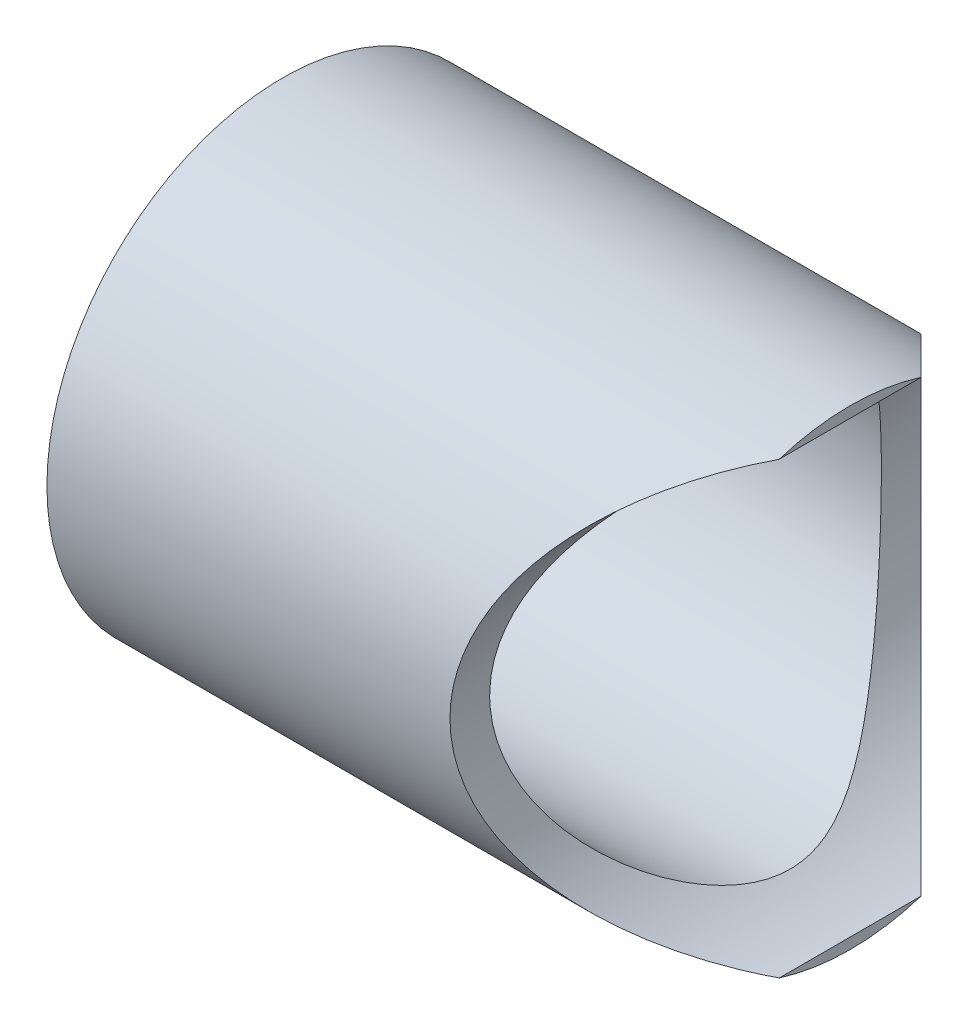
ISO-10303-21;
HEADER;
FILE_DESCRIPTION(('STEP AP214'),'2;1');
FILE_NAME('part.step','',(''),(''),'','','');
FILE_SCHEMA(('AUTOMOTIVE_DESIGN { 1 0 10303 214 1 1 1 1 }'));
ENDSEC;
DATA;
#1=APPLICATION_CONTEXT('core data for automotive mechanical design processes');
#2=APPLICATION_PROTOCOL_DEFINITION('international standard','automotive_design',2000,#1);
#3=PRODUCT_CONTEXT('',#1,'mechanical');
#4=PRODUCT('Part','Part','',(#3));
#5=PRODUCT_RELATED_PRODUCT_CATEGORY('part','',(#4));
#6=PRODUCT_DEFINITION_FORMATION('','',#4);
#7=PRODUCT_DEFINITION_CONTEXT('part definition',#1,'design');
#8=PRODUCT_DEFINITION('design','',#6,#7);
#9=PRODUCT_DEFINITION_SHAPE('','',#8);
#10=(LENGTH_UNIT() NAMED_UNIT(*) SI_UNIT(.MILLI.,.METRE.));
#11=(NAMED_UNIT(*) PLANE_ANGLE_UNIT() SI_UNIT($,.RADIAN.));
#12=(NAMED_UNIT(*) SI_UNIT($,.STERADIAN.) SOLID_ANGLE_UNIT());
#13=UNCERTAINTY_MEASURE_WITH_UNIT(LENGTH_MEASURE(1.E-05),#10,'distance_accuracy_value','');
#14=(GEOMETRIC_REPRESENTATION_CONTEXT(3) GLOBAL_UNCERTAINTY_ASSIGNED_CONTEXT((#13)) GLOBAL_UNIT_ASSIGNED_CONTEXT((#10,
#11,#12)) REPRESENTATION_CONTEXT('',''));
#15=CARTESIAN_POINT('',(0.,0.,0.));
#16=DIRECTION('',(0.,0.,1.));
#17=DIRECTION('',(1.,0.,0.));
#18=AXIS2_PLACEMENT_3D('',#15,#16,#17);
#19=CARTESIAN_POINT('',(568.325,28.575,31.75));
#20=DIRECTION('',(1.,0.,0.));
#21=DIRECTION('',(0.,0.,-1.));
#22=AXIS2_PLACEMENT_3D('',#19,#20,#21);
#23=CYLINDRICAL_SURFACE('',#22,17.526);
#24=CARTESIAN_POINT('',(517.525,28.575,31.75));
#25=DIRECTION('',(1.,0.,0.));
#26=DIRECTION('',(0.,0.,-1.));
#27=AXIS2_PLACEMENT_3D('',#24,#25,#26);
#28=CIRCLE('',#27,17.526);
#29=CARTESIAN_POINT('',(517.525,28.575,14.224));
#30=VERTEX_POINT('',#29);
#31=EDGE_CURVE('E50',#30,#30,#28,.F.);
#32=ORIENTED_EDGE('',*,*,#31,.T.);
#33=EDGE_LOOP('',(#32));
#34=FACE_BOUND('',#33,.T.);
#35=CARTESIAN_POINT('',(553.6132342657,27.651553554921,49.2516549780934));
#36=CARTESIAN_POINT('',(553.63194520487,27.2248883758585,49.2291386511275));
#37=CARTESIAN_POINT('',(553.663610725579,26.7995434640195,49.1910242975839));
#38=CARTESIAN_POINT('',(553.752104841597,25.9551538969349,49.0843120614281));
#39=CARTESIAN_POINT('',(553.808948425233,25.536113148377,49.0156960212857));
#40=CARTESIAN_POINT('',(553.946600456313,24.7070400392876,48.8490849594317));
#41=CARTESIAN_POINT('',(554.027457627212,24.2970278321291,48.7510302022475));
#42=CARTESIAN_POINT('',(554.211300770934,23.4898151176844,48.527276357537));
#43=CARTESIAN_POINT('',(554.314283998306,23.0926130279163,48.4015806997102));
#44=CARTESIAN_POINT('',(554.539434674483,22.3162582315454,48.1255083294046));
#45=CARTESIAN_POINT('',(554.661447416689,21.9369895887926,47.9753302440843));
#46=CARTESIAN_POINT('',(554.92303896723,21.1949212814435,47.6515413924575));
#47=CARTESIAN_POINT('',(555.062617896931,20.8321217306567,47.4779304642516));
#48=CARTESIAN_POINT('',(555.357071377504,20.1242436265885,47.1091874654224));
#49=CARTESIAN_POINT('',(555.511942875587,19.7791615572673,46.9140596892073));
#50=CARTESIAN_POINT('',(555.834786549205,19.1073688486667,46.5039680266759));
#51=CARTESIAN_POINT('',(556.002761479555,18.780662097528,46.2889999674622));
#52=CARTESIAN_POINT('',(556.417437189112,18.0220383365812,45.7531298265484));
#53=CARTESIAN_POINT('',(556.669242607125,17.5989227834955,45.4236685216114));
#54=CARTESIAN_POINT('',(557.188161904108,16.7897380298935,44.7327405120848));
#55=CARTESIAN_POINT('',(557.455281581414,16.4036830113016,44.3712616562968));
#56=CARTESIAN_POINT('',(557.999542924498,15.6680400337881,43.6179753752106));
#57=CARTESIAN_POINT('',(558.276705238362,15.3185337076635,43.2261033255249));
#58=CARTESIAN_POINT('',(558.834279074004,14.6570525248326,42.4142205291843));
#59=CARTESIAN_POINT('',(559.11468983232,14.3450690379657,41.9942162875963));
#60=CARTESIAN_POINT('',(559.632011572531,13.8007185942458,41.1883641337813));
#61=CARTESIAN_POINT('',(559.869415567063,13.5633444865263,40.8062049143649));
#62=CARTESIAN_POINT('',(560.336291867032,13.1167833955922,40.0209297923646));
#63=CARTESIAN_POINT('',(560.565762786849,12.9076013181969,39.617810259254));
#64=CARTESIAN_POINT('',(561.009597244898,12.5190276239063,38.7909265661389));
#65=CARTESIAN_POINT('',(561.223997027915,12.3395630224725,38.3672163919918));
#66=CARTESIAN_POINT('',(561.629877023419,12.0116838635953,37.497430730021));
#67=CARTESIAN_POINT('',(561.821372397404,11.8632487170933,37.0513703174964));
#68=CARTESIAN_POINT('',(562.102380222919,11.6517094609978,36.3158189708982));
#69=CARTESIAN_POINT('',(562.202466650341,11.5779501485683,36.0334054398798));
#70=CARTESIAN_POINT('',(562.387406449854,11.4437769399667,35.4605730507806));
#71=CARTESIAN_POINT('',(562.472265291171,11.3833582504955,35.1701571102972));
#72=CARTESIAN_POINT('',(562.623719926992,11.2768510445484,34.5826056062548));
#73=CARTESIAN_POINT('',(562.690351854318,11.2307341517171,34.2854846199364));
#74=CARTESIAN_POINT('',(562.802812907537,11.153559923682,33.6853537317127));
#75=CARTESIAN_POINT('',(562.848642594221,11.1225021825086,33.3823439887875));
#76=CARTESIAN_POINT('',(562.917618597342,11.0759576435488,32.7695518417687));
#77=CARTESIAN_POINT('',(562.940542440761,11.0606235246119,32.4597323258211));
#78=CARTESIAN_POINT('',(562.961686457704,11.0464752489035,31.8388774861905));
#79=CARTESIAN_POINT('',(562.959907912927,11.0476602350271,31.5278422264245));
#80=CARTESIAN_POINT('',(562.93173779112,11.066522239054,30.9071721607199));
#81=CARTESIAN_POINT('',(562.905327611075,11.0842117219627,30.5975385910322));
#82=CARTESIAN_POINT('',(562.829287785697,11.1356221445223,29.9824960146833));
#83=CARTESIAN_POINT('',(562.779654559099,11.1693455568054,29.6770876670823));
#84=CARTESIAN_POINT('',(562.648964561793,11.2593267827706,29.019268462287));
#85=CARTESIAN_POINT('',(562.563912440033,11.3185077514551,28.668055245452));
#86=CARTESIAN_POINT('',(562.369714116579,11.4564489198209,27.9763557783631));
#87=CARTESIAN_POINT('',(562.260561787034,11.5352140997344,27.6358722815126));
#88=CARTESIAN_POINT('',(562.022670875519,11.7110977346963,26.9656652776437));
#89=CARTESIAN_POINT('',(561.893879122912,11.8082661919802,26.6359740246217));
#90=CARTESIAN_POINT('',(561.621321691653,12.019578309619,25.9885187714622));
#91=CARTESIAN_POINT('',(561.477555053138,12.1337230583244,25.6707555376673));
#92=CARTESIAN_POINT('',(561.092030360477,12.4490441504447,24.8656000598376));
#93=CARTESIAN_POINT('',(560.841869054055,12.662255199984,24.3869171130994));
#94=CARTESIAN_POINT('',(560.325413057825,13.1263464140543,23.4572406747956));
#95=CARTESIAN_POINT('',(560.059109583728,13.377247200475,23.0062625333936));
#96=CARTESIAN_POINT('',(559.519003931967,13.9157993131415,22.1305941430944));
#97=CARTESIAN_POINT('',(559.245192679099,14.2034968092986,21.7059379323095));
#98=CARTESIAN_POINT('',(558.697610994296,14.8148321611511,20.8834956212188));
#99=CARTESIAN_POINT('',(558.423840564892,15.1384629546108,20.4857042655943));
#100=CARTESIAN_POINT('',(557.872486123842,15.8341072768717,19.703671078198));
#101=CARTESIAN_POINT('',(557.595127555098,16.207455477515,19.3204535192803));
#102=CARTESIAN_POINT('',(557.053147217793,16.9927394643264,18.5856108378868));
#103=CARTESIAN_POINT('',(556.78852764483,17.4046818665106,18.2339911523955));
#104=CARTESIAN_POINT('',(556.278735946374,18.2658875770051,17.5662476614208));
#105=CARTESIAN_POINT('',(556.033518005512,18.7150575018149,17.2500394528142));
#106=CARTESIAN_POINT('',(555.684541741303,19.416318876866,16.8049043481795));
#107=CARTESIAN_POINT('',(555.571372631905,19.6546217657449,16.6614069120782));
#108=CARTESIAN_POINT('',(555.352015446805,20.1403100336688,16.3846227104059));
#109=CARTESIAN_POINT('',(555.245829019299,20.387697535729,16.2513383543182));
#110=CARTESIAN_POINT('',(555.000724302809,20.9909703069176,15.9449832838886));
#111=CARTESIAN_POINT('',(554.865504638994,21.3510115435203,15.777069445988));
#112=CARTESIAN_POINT('',(554.612468644417,22.0867901817555,15.4643143020721));
#113=CARTESIAN_POINT('',(554.494647792276,22.4625234728667,15.319467001054));
#114=CARTESIAN_POINT('',(554.278486111935,23.2279462607529,15.0546840261331));
#115=CARTESIAN_POINT('',(554.180136041327,23.6176290317469,14.9347365314501));
#116=CARTESIAN_POINT('',(554.004758658889,24.4089395054123,14.721420567036));
#117=CARTESIAN_POINT('',(553.927731902221,24.8105675187823,14.6280527893184));
#118=CARTESIAN_POINT('',(553.796242064934,25.6255022994863,14.4689553147242));
#119=CARTESIAN_POINT('',(553.741917605387,26.0388648166704,14.4033953782025));
#120=CARTESIAN_POINT('',(553.657753481509,26.8717012490999,14.3019225005658));
#121=CARTESIAN_POINT('',(553.62791377489,27.2911751537892,14.2660095082485));
#122=CARTESIAN_POINT('',(553.593438891844,28.1325659071851,14.2245241417151));
#123=CARTESIAN_POINT('',(553.588798137692,28.5544821945764,14.2189450531651));
#124=CARTESIAN_POINT('',(553.604822338428,29.3971171081654,14.2382219768659));
#125=CARTESIAN_POINT('',(553.62548566314,29.8178358097656,14.2630760285074));
#126=CARTESIAN_POINT('',(553.688561885376,30.6159230296238,14.3390570919545));
#127=CARTESIAN_POINT('',(553.728799395593,30.9937194250996,14.3875571914302));
#128=CARTESIAN_POINT('',(553.828929712951,31.7427812450288,14.5084876261824));
#129=CARTESIAN_POINT('',(553.888821064225,32.1140471510855,14.5809161889501));
#130=CARTESIAN_POINT('',(554.027171891085,32.8478640262591,14.7486763247663));
#131=CARTESIAN_POINT('',(554.105633783347,33.2104138543399,14.8440108787089));
#132=CARTESIAN_POINT('',(554.279783315149,33.9248674991795,15.0563334639196));
#133=CARTESIAN_POINT('',(554.375471946737,34.2767707014593,15.1733227422455));
#134=CARTESIAN_POINT('',(554.587686804472,34.9854655883076,15.4338700258967));
#135=CARTESIAN_POINT('',(554.705008685464,35.3416405381559,15.5784547566225));
#136=CARTESIAN_POINT('',(554.955115211802,36.0391932726219,15.8883425772297));
#137=CARTESIAN_POINT('',(555.087899920565,36.3805709965454,16.0536457520817));
#138=CARTESIAN_POINT('',(555.367046494505,37.0475647296723,16.4034001140338));
#139=CARTESIAN_POINT('',(555.513408197233,37.373180927393,16.5878510720319));
#140=CARTESIAN_POINT('',(555.817842140174,38.0080442128938,16.9744614103542));
#141=CARTESIAN_POINT('',(555.975916710006,38.3172880232222,17.1766243149432));
#142=CARTESIAN_POINT('',(556.378205331234,39.0597598160949,17.6957887790919));
#143=CARTESIAN_POINT('',(556.628123801946,39.4833160904537,18.0222722641876));
#144=CARTESIAN_POINT('',(557.143476858452,40.2936677242439,18.7071784771929));
#145=CARTESIAN_POINT('',(557.408917656656,40.6804482002273,19.0656140236019));
#146=CARTESIAN_POINT('',(557.950651241676,41.4185696710951,19.8134758321492));
#147=CARTESIAN_POINT('',(558.226985186979,41.7697538179872,20.2030267848255));
#148=CARTESIAN_POINT('',(558.783282553627,42.4347211063087,21.0102486787127));
#149=CARTESIAN_POINT('',(559.063245346979,42.7485106257463,21.4279148055429));
#150=CARTESIAN_POINT('',(559.625039046534,43.3438829297907,22.2988544801845));
#151=CARTESIAN_POINT('',(559.906811272405,43.6247758999826,22.7526376007066));
#152=CARTESIAN_POINT('',(560.458476862686,44.1469381906452,23.6900082577222));
#153=CARTESIAN_POINT('',(560.728363228186,44.3881843878374,24.1736129626192));
#154=CARTESIAN_POINT('',(561.11459737276,44.7179489663258,24.9207034971402));
#155=CARTESIAN_POINT('',(561.239928719899,44.8222804520433,25.1726371069142));
#156=CARTESIAN_POINT('',(561.482889061811,45.0201661238954,25.6843157565481));
#157=CARTESIAN_POINT('',(561.600517366609,45.1137193451689,25.9440614931224));
#158=CARTESIAN_POINT('',(561.938532613595,45.3772129267124,26.7345969811829));
#159=CARTESIAN_POINT('',(562.144573565655,45.5304248798189,27.2776663439227));
#160=CARTESIAN_POINT('',(562.408721562727,45.721454767561,28.1113403675841));
#161=CARTESIAN_POINT('',(562.488946350962,45.7784454842204,28.3907307055572));
#162=CARTESIAN_POINT('',(562.632545549384,45.8792680200226,28.9561877305159));
#163=CARTESIAN_POINT('',(562.695922688387,45.9231019703182,29.2422533281335));
#164=CARTESIAN_POINT('',(562.803266107254,45.9967369819231,29.8191654017342));
#165=CARTESIAN_POINT('',(562.847274457066,46.026568466739,30.1100000784274));
#166=CARTESIAN_POINT('',(562.914128823784,46.0716933051478,30.6952451785388));
#167=CARTESIAN_POINT('',(562.936975128598,46.0869868565273,30.9896555532549));
#168=CARTESIAN_POINT('',(562.960445793863,46.1026967996271,31.5812183700853));
#169=CARTESIAN_POINT('',(562.960960707175,46.1030399186543,31.878377179466));
#170=CARTESIAN_POINT('',(562.939466250044,46.0886555348839,32.4714956001302));
#171=CARTESIAN_POINT('',(562.917457043358,46.073928141653,32.7674552201164));
#172=CARTESIAN_POINT('',(562.8519492719,46.0297340043308,33.356321991147));
#173=CARTESIAN_POINT('',(562.808416441744,46.000243756991,33.6492235120182));
#174=CARTESIAN_POINT('',(562.701813002513,45.9271660927924,34.2296425693812));
#175=CARTESIAN_POINT('',(562.638739242296,45.8835764022278,34.5171592295824));
#176=CARTESIAN_POINT('',(562.471450550931,45.7662113088862,35.1809636469712));
#177=CARTESIAN_POINT('',(562.360532700913,45.6872147996495,35.5546411138729));
#178=CARTESIAN_POINT('',(562.114425943304,45.5073914325159,36.288469255427));
#179=CARTESIAN_POINT('',(561.979227088422,45.406555624132,36.6486143128115));
#180=CARTESIAN_POINT('',(561.689935243358,45.1843993979504,37.3559195827515));
#181=CARTESIAN_POINT('',(561.53578943368,45.0630213418559,37.7030398056626));
#182=CARTESIAN_POINT('',(561.213859888931,44.8012605524445,38.3833998872501));
#183=CARTESIAN_POINT('',(561.04607611074,44.6608777590384,38.7166397020351));
#184=CARTESIAN_POINT('',(560.608888433648,44.2822431140733,39.5440181955591));
#185=CARTESIAN_POINT('',(560.333019323547,44.0317302471893,40.0291637236574));
#186=CARTESIAN_POINT('',(559.770344380905,43.4899203781357,40.9695660105656));
#187=CARTESIAN_POINT('',(559.483533061258,43.1986027129858,41.4248074537198));
#188=CARTESIAN_POINT('',(558.907928237572,42.5760680707158,42.3056380817096));
#189=CARTESIAN_POINT('',(558.619135115743,42.2448585939068,42.7312328169329));
#190=CARTESIAN_POINT('',(558.046944152441,41.5427881044087,43.5520611165449));
#191=CARTESIAN_POINT('',(557.763544552721,41.171940283691,43.9473047072584));
#192=CARTESIAN_POINT('',(557.250932347177,40.4500855223074,44.6479050542135));
#193=CARTESIAN_POINT('',(557.020039517338,40.1046556062591,44.9577848113516));
#194=CARTESIAN_POINT('',(556.570674961483,39.3853621872912,45.5527003561297));
#195=CARTESIAN_POINT('',(556.352203425436,39.0114982497112,45.8377357638404));
#196=CARTESIAN_POINT('',(555.931854101961,38.2362330862182,46.3802707735648));
#197=CARTESIAN_POINT('',(555.72995716844,37.834864644554,46.6378022531986));
#198=CARTESIAN_POINT('',(555.346483507056,37.0051764153915,47.1228182191357));
#199=CARTESIAN_POINT('',(555.164901539806,36.5768636217786,47.3503104555345));
#200=CARTESIAN_POINT('',(554.859167605639,35.7811124675231,47.7308430870276));
#201=CARTESIAN_POINT('',(554.730724938503,35.4181178398957,47.8897474704415));
#202=CARTESIAN_POINT('',(554.491683681334,34.6771247635223,48.1842206324835));
#203=CARTESIAN_POINT('',(554.381081327874,34.29912950019,48.3197943331404));
#204=CARTESIAN_POINT('',(554.179872499111,33.5305993738711,48.5656230781489));
#205=CARTESIAN_POINT('',(554.089229606597,33.140088862956,48.6759242488807));
#206=CARTESIAN_POINT('',(553.929502635769,32.3483283527259,48.8698317633874));
#207=CARTESIAN_POINT('',(553.860407994454,31.9470837203728,48.9534511870816));
#208=CARTESIAN_POINT('',(553.754934175882,31.2050818274989,49.0809015698986));
#209=CARTESIAN_POINT('',(553.714999015169,30.8655660207117,49.1290691186784));
#210=CARTESIAN_POINT('',(553.651619441307,30.1829683550343,49.2054559078415));
#211=CARTESIAN_POINT('',(553.628164234457,29.8398889798614,49.2336882050669));
#212=CARTESIAN_POINT('',(553.599707448171,29.189094492885,49.2679332439175));
#213=CARTESIAN_POINT('',(553.592986695636,28.8815610323838,49.2760161104759));
#214=CARTESIAN_POINT('',(553.593013357231,28.2663083269467,49.2759838258615));
#215=CARTESIAN_POINT('',(553.599769554887,27.9585890916039,49.2678581108385));
#216=CARTESIAN_POINT('',(553.6132342657,27.651553554921,49.2516549780934));
#217=B_SPLINE_CURVE_WITH_KNOTS('',3,(#35,#36,#37,#38,#39,#40,#41,#42,#43,#44,#45,#46,#47,#48,
#49,#50,#51,#52,#53,#54,#55,#56,#57,#58,#59,#60,#61,#62,#63,#64,#65,#66,#67,#68,#69,#70,#71,#72,
#73,#74,#75,#76,#77,#78,#79,#80,#81,#82,#83,#84,#85,#86,#87,#88,#89,#90,#91,#92,#93,#94,#95,#96,
#97,#98,#99,#100,#101,#102,#103,#104,#105,#106,#107,#108,#109,#110,#111,#112,#113,#114,#115,
#116,#117,#118,#119,#120,#121,#122,#123,#124,#125,#126,#127,#128,#129,#130,#131,#132,#133,#134,
#135,#136,#137,#138,#139,#140,#141,#142,#143,#144,#145,#146,#147,#148,#149,#150,#151,#152,#153,
#154,#155,#156,#157,#158,#159,#160,#161,#162,#163,#164,#165,#166,#167,#168,#169,#170,#171,#172,
#173,#174,#175,#176,#177,#178,#179,#180,#181,#182,#183,#184,#185,#186,#187,#188,#189,#190,#191,
#192,#193,#194,#195,#196,#197,#198,#199,#200,#201,#202,#203,#204,#205,#206,#207,#208,#209,#210,
#211,#212,#213,#214,#215,#216),.UNSPECIFIED.,.T.,.F.,(4,2,2,2,2,2,2,2,2,2,2,2,2,2,2,2,2,2,2,2,2,
2,2,2,2,2,2,2,2,2,2,2,2,2,2,2,2,2,2,2,2,2,2,2,2,2,2,2,2,2,2,2,2,2,2,2,2,2,2,2,2,2,2,2,2,2,2,2,2,
2,2,2,2,2,2,2,2,2,2,2,2,2,2,2,2,2,2,2,2,2,4),(0.,1.2826605077742,2.56608560281955,
3.85213276207059,5.13802043776833,6.41395217147338,7.68989272114422,8.96557907346167,
10.2415343479695,12.0163152153015,13.7917725517058,15.5711143417813,17.3500461018274,
18.8749141189753,20.4000471434567,21.9213771095542,23.4416943966373,24.3667627277754,
25.2914981381263,26.214386855137,27.1372506912266,28.0689931711588,29.0006873071833,
29.933085674392,30.8656278757265,31.9624477123945,33.059546754293,34.1596705566528,
35.2598649184049,36.9992682209354,38.739626725729,40.4821907343901,42.2244128683109,
44.0302161974648,45.8363296550889,47.6380422599454,48.538646209474,49.439461980656,
50.6971535136806,51.9545176367696,53.2112834745758,54.4680820297837,55.7324463122808,
56.996808411133,58.2608906351888,59.5248914269274,60.6726272861738,61.8202781455652,
62.9680784366185,64.1159448480606,65.3204949282404,66.5250499486881,67.7295905583748,
68.9343713902953,70.702730957428,72.4718031739328,74.2483594050642,76.0246121926998,
77.8331810633497,79.6428010348138,80.5427553506984,81.4427901672449,83.2392899850787,
84.1272681146039,85.0151023303731,85.900998493841,86.7868826046347,87.6771079845613,
88.5673268923577,89.4589676049398,90.3507521771168,91.5419875327467,92.733712024066,
93.9288374912368,95.1239667372423,96.9566067383891,98.790178140628,100.623405338124,
102.456024310901,104.009597063075,105.563193568914,107.114969422952,108.666344134809,
109.914797114956,111.162986387647,112.408879039801,113.654159989084,114.688924306113,
115.723010261111,116.645433249095,117.568457617411),.UNSPECIFIED.);
#218=CARTESIAN_POINT('',(553.6132342657,27.651553554921,49.2516549780934));
#219=VERTEX_POINT('',#218);
#220=EDGE_CURVE('E18',#219,#219,#217,.T.);
#221=ORIENTED_EDGE('',*,*,#220,.T.);
#222=EDGE_LOOP('',(#221));
#223=FACE_BOUND('',#222,.T.);
#224=ADVANCED_FACE('F14',(#34,#223),#23,.F.);
#225=CARTESIAN_POINT('',(568.325,28.575,993.775));
#226=DIRECTION('',(1.,0.,0.));
#227=DIRECTION('',(0.,0.,-1.));
#228=AXIS2_PLACEMENT_3D('',#225,#226,#227);
#229=PLANE('',#228);
#230=DIRECTION('',(0.,0.,1.));
#231=VECTOR('',#230,1.);
#232=CARTESIAN_POINT('',(568.325,8.4720593195921,76.2));
#233=LINE('',#232,#231);
#234=CARTESIAN_POINT('',(568.325,8.4720593195921,25.3999999999999));
#235=VERTEX_POINT('',#234);
#236=CARTESIAN_POINT('',(568.325,8.47205931959211,38.1000000000001));
#237=VERTEX_POINT('',#236);
#238=EDGE_CURVE('E45',#235,#237,#233,.T.);
#239=ORIENTED_EDGE('',*,*,#238,.T.);
#240=CARTESIAN_POINT('',(568.325,28.575,31.75));
#241=DIRECTION('',(1.,0.,0.));
#242=DIRECTION('',(0.,0.,-1.));
#243=AXIS2_PLACEMENT_3D('',#240,#241,#242);
#244=CIRCLE('',#243,21.082);
#245=EDGE_CURVE('E43',#235,#237,#244,.F.);
#246=ORIENTED_EDGE('',*,*,#245,.F.);
#247=EDGE_LOOP('',(#239,#246));
#248=FACE_BOUND('',#247,.T.);
#249=ADVANCED_FACE('F47',(#248),#229,.T.);
#250=CARTESIAN_POINT('',(568.325,28.575,993.775));
#251=DIRECTION('',(1.,0.,0.));
#252=DIRECTION('',(0.,0.,-1.));
#253=AXIS2_PLACEMENT_3D('',#250,#251,#252);
#254=PLANE('',#253);
#255=DIRECTION('',(0.,0.,1.));
#256=VECTOR('',#255,1.);
#257=CARTESIAN_POINT('',(568.325,48.6779406804079,76.2));
#258=LINE('',#257,#256);
#259=CARTESIAN_POINT('',(568.325,48.6779406804079,38.1000000000001));
#260=VERTEX_POINT('',#259);
#261=CARTESIAN_POINT('',(568.325,48.6779406804079,25.3999999999999));
#262=VERTEX_POINT('',#261);
#263=EDGE_CURVE('E35',#260,#262,#258,.F.);
#264=ORIENTED_EDGE('',*,*,#263,.T.);
#265=CARTESIAN_POINT('',(568.325,28.575,31.75));
#266=DIRECTION('',(1.,0.,0.));
#267=DIRECTION('',(0.,0.,-1.));
#268=AXIS2_PLACEMENT_3D('',#265,#266,#267);
#269=CIRCLE('',#268,21.082);
#270=EDGE_CURVE('E58',#260,#262,#269,.F.);
#271=ORIENTED_EDGE('',*,*,#270,.F.);
#272=EDGE_LOOP('',(#264,#271));
#273=FACE_BOUND('',#272,.T.);
#274=ADVANCED_FACE('F71',(#273),#254,.T.);
#275=CARTESIAN_POINT('',(574.675,28.575,76.2));
#276=DIRECTION('',(0.,0.,1.));
#277=DIRECTION('',(1.,0.,0.));
#278=AXIS2_PLACEMENT_3D('',#275,#276,#277);
#279=CYLINDRICAL_SURFACE('',#278,21.082);
#280=CARTESIAN_POINT('',(574.675,28.575,31.75));
#281=DIRECTION('',(-0.707106781186547,0.,0.707106781186547));
#282=DIRECTION('',(0.707106781186547,0.,0.707106781186547));
#283=AXIS2_PLACEMENT_3D('',#280,#281,#282);
#284=ELLIPSE('',#283,29.8144503219496,21.082);
#285=EDGE_CURVE('E27',#262,#235,#284,.T.);
#286=ORIENTED_EDGE('',*,*,#285,.F.);
#287=ORIENTED_EDGE('',*,*,#263,.F.);
#288=CARTESIAN_POINT('',(574.675,28.575,31.75));
#289=DIRECTION('',(0.707106781186547,0.,0.707106781186547));
#290=DIRECTION('',(-0.707106781186547,0.,0.707106781186547));
#291=AXIS2_PLACEMENT_3D('',#288,#289,#290);
#292=ELLIPSE('',#291,29.8144503219496,21.082);
#293=EDGE_CURVE('E53',#237,#260,#292,.F.);
#294=ORIENTED_EDGE('',*,*,#293,.F.);
#295=ORIENTED_EDGE('',*,*,#238,.F.);
#296=EDGE_LOOP('',(#286,#287,#294,#295));
#297=FACE_BOUND('',#296,.T.);
#298=ORIENTED_EDGE('',*,*,#220,.F.);
#299=EDGE_LOOP('',(#298));
#300=FACE_BOUND('',#299,.T.);
#301=ADVANCED_FACE('F54',(#297,#300),#279,.F.);
#302=CARTESIAN_POINT('',(517.525,28.575,993.775));
#303=DIRECTION('',(1.,0.,0.));
#304=DIRECTION('',(0.,0.,-1.));
#305=AXIS2_PLACEMENT_3D('',#302,#303,#304);
#306=PLANE('',#305);
#307=CARTESIAN_POINT('',(517.525,28.575,31.75));
#308=DIRECTION('',(1.,0.,0.));
#309=DIRECTION('',(0.,0.,-1.));
#310=AXIS2_PLACEMENT_3D('',#307,#308,#309);
#311=CIRCLE('',#310,21.082);
#312=CARTESIAN_POINT('',(517.525,28.575,10.668));
#313=VERTEX_POINT('',#312);
#314=EDGE_CURVE('E9',#313,#313,#311,.T.);
#315=ORIENTED_EDGE('',*,*,#314,.F.);
#316=EDGE_LOOP('',(#315));
#317=FACE_BOUND('',#316,.T.);
#318=ORIENTED_EDGE('',*,*,#31,.F.);
#319=EDGE_LOOP('',(#318));
#320=FACE_BOUND('',#319,.T.);
#321=ADVANCED_FACE('F70',(#317,#320),#306,.F.);
#322=CARTESIAN_POINT('',(568.325,28.575,31.75));
#323=DIRECTION('',(1.,0.,0.));
#324=DIRECTION('',(0.,0.,-1.));
#325=AXIS2_PLACEMENT_3D('',#322,#323,#324);
#326=CYLINDRICAL_SURFACE('',#325,21.082);
#327=ORIENTED_EDGE('',*,*,#314,.T.);
#328=EDGE_LOOP('',(#327));
#329=FACE_BOUND('',#328,.T.);
#330=ORIENTED_EDGE('',*,*,#270,.T.);
#331=ORIENTED_EDGE('',*,*,#285,.T.);
#332=ORIENTED_EDGE('',*,*,#245,.T.);
#333=ORIENTED_EDGE('',*,*,#293,.T.);
#334=EDGE_LOOP('',(#330,#331,#332,#333));
#335=FACE_BOUND('',#334,.T.);
#336=ADVANCED_FACE('F60',(#329,#335),#326,.T.);
#337=CLOSED_SHELL('',(#224,#249,#274,#301,#321,#336));
#338=MANIFOLD_SOLID_BREP('B1',#337);
#339=ADVANCED_BREP_SHAPE_REPRESENTATION('',(#18,#338),#14);
#340=SHAPE_DEFINITION_REPRESENTATION(#9,#339);
ENDSEC;
END-ISO-10303-21;
